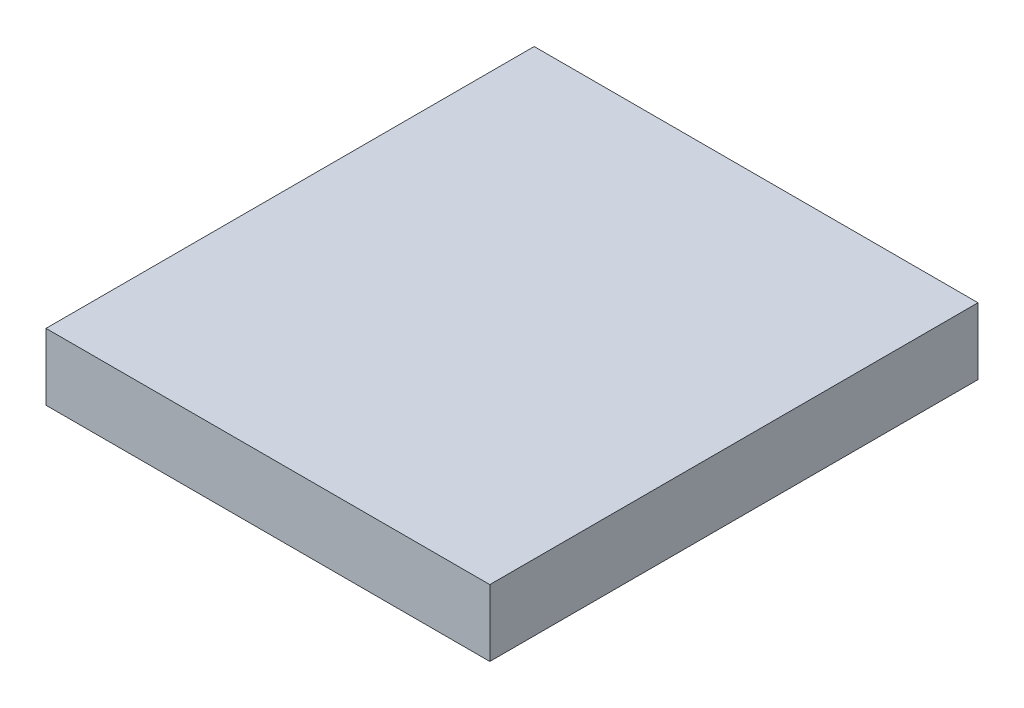
ISO-10303-21;
HEADER;
FILE_DESCRIPTION(('STEP AP214'),'2;1');
FILE_NAME('part.step','',(''),(''),'','','');
FILE_SCHEMA(('AUTOMOTIVE_DESIGN { 1 0 10303 214 1 1 1 1 }'));
ENDSEC;
DATA;
#1=APPLICATION_CONTEXT('core data for automotive mechanical design processes');
#2=APPLICATION_PROTOCOL_DEFINITION('international standard','automotive_design',2000,#1);
#3=PRODUCT_CONTEXT('',#1,'mechanical');
#4=PRODUCT('Part','Part','',(#3));
#5=PRODUCT_RELATED_PRODUCT_CATEGORY('part','',(#4));
#6=PRODUCT_DEFINITION_FORMATION('','',#4);
#7=PRODUCT_DEFINITION_CONTEXT('part definition',#1,'design');
#8=PRODUCT_DEFINITION('design','',#6,#7);
#9=PRODUCT_DEFINITION_SHAPE('','',#8);
#10=(LENGTH_UNIT() NAMED_UNIT(*) SI_UNIT(.MILLI.,.METRE.));
#11=(NAMED_UNIT(*) PLANE_ANGLE_UNIT() SI_UNIT($,.RADIAN.));
#12=(NAMED_UNIT(*) SI_UNIT($,.STERADIAN.) SOLID_ANGLE_UNIT());
#13=UNCERTAINTY_MEASURE_WITH_UNIT(LENGTH_MEASURE(1.E-05),#10,'distance_accuracy_value','');
#14=(GEOMETRIC_REPRESENTATION_CONTEXT(3) GLOBAL_UNCERTAINTY_ASSIGNED_CONTEXT((#13)) GLOBAL_UNIT_ASSIGNED_CONTEXT((#10,
#11,#12)) REPRESENTATION_CONTEXT('',''));
#15=CARTESIAN_POINT('',(0.,0.,0.));
#16=DIRECTION('',(0.,0.,1.));
#17=DIRECTION('',(1.,0.,0.));
#18=AXIS2_PLACEMENT_3D('',#15,#16,#17);
#19=CARTESIAN_POINT('',(7.9375,-2.38252,-8.73124999999999));
#20=DIRECTION('',(1.,0.,0.));
#21=DIRECTION('',(0.,0.,-1.));
#22=AXIS2_PLACEMENT_3D('',#19,#20,#21);
#23=PLANE('',#22);
#24=DIRECTION('',(0.,0.,-1.));
#25=VECTOR('',#24,1.);
#26=CARTESIAN_POINT('',(7.9375,0.,-8.73124999999999));
#27=LINE('',#26,#25);
#28=CARTESIAN_POINT('',(7.93750000000001,0.,8.73125000000001));
#29=VERTEX_POINT('',#28);
#30=CARTESIAN_POINT('',(7.9375,0.,-8.73124999999999));
#31=VERTEX_POINT('',#30);
#32=EDGE_CURVE('E100',#29,#31,#27,.T.);
#33=ORIENTED_EDGE('',*,*,#32,.F.);
#34=DIRECTION('',(0.,1.,0.));
#35=VECTOR('',#34,1.);
#36=CARTESIAN_POINT('',(7.93750000000001,-2.38252,8.73125000000001));
#37=LINE('',#36,#35);
#38=CARTESIAN_POINT('',(7.93750000000001,-2.38252,8.73125000000001));
#39=VERTEX_POINT('',#38);
#40=EDGE_CURVE('E11',#39,#29,#37,.T.);
#41=ORIENTED_EDGE('',*,*,#40,.F.);
#42=DIRECTION('',(0.,0.,-1.));
#43=VECTOR('',#42,1.);
#44=CARTESIAN_POINT('',(7.9375,-2.38252,-8.73124999999999));
#45=LINE('',#44,#43);
#46=CARTESIAN_POINT('',(7.9375,-2.38252,-8.73124999999999));
#47=VERTEX_POINT('',#46);
#48=EDGE_CURVE('E94',#39,#47,#45,.T.);
#49=ORIENTED_EDGE('',*,*,#48,.T.);
#50=DIRECTION('',(0.,1.,0.));
#51=VECTOR('',#50,1.);
#52=CARTESIAN_POINT('',(7.9375,-2.38252,-8.73124999999999));
#53=LINE('',#52,#51);
#54=EDGE_CURVE('E39',#47,#31,#53,.T.);
#55=ORIENTED_EDGE('',*,*,#54,.T.);
#56=EDGE_LOOP('',(#33,#41,#49,#55));
#57=FACE_BOUND('',#56,.T.);
#58=ADVANCED_FACE('F36',(#57),#23,.T.);
#59=CARTESIAN_POINT('',(-7.93749999999999,-2.38252,8.73125000000001));
#60=DIRECTION('',(0.,0.,1.));
#61=DIRECTION('',(1.,0.,0.));
#62=AXIS2_PLACEMENT_3D('',#59,#60,#61);
#63=PLANE('',#62);
#64=DIRECTION('',(1.,0.,0.));
#65=VECTOR('',#64,1.);
#66=CARTESIAN_POINT('',(-7.93749999999999,0.,8.73125000000001));
#67=LINE('',#66,#65);
#68=CARTESIAN_POINT('',(-7.93749999999999,0.,8.73125000000001));
#69=VERTEX_POINT('',#68);
#70=EDGE_CURVE('E96',#69,#29,#67,.T.);
#71=ORIENTED_EDGE('',*,*,#70,.F.);
#72=DIRECTION('',(0.,1.,0.));
#73=VECTOR('',#72,1.);
#74=CARTESIAN_POINT('',(-7.93749999999999,-2.38252,8.73125000000001));
#75=LINE('',#74,#73);
#76=CARTESIAN_POINT('',(-7.93749999999999,-2.38252,8.73125000000001));
#77=VERTEX_POINT('',#76);
#78=EDGE_CURVE('E45',#77,#69,#75,.T.);
#79=ORIENTED_EDGE('',*,*,#78,.F.);
#80=DIRECTION('',(1.,0.,0.));
#81=VECTOR('',#80,1.);
#82=CARTESIAN_POINT('',(-7.93749999999999,-2.38252,8.73125000000001));
#83=LINE('',#82,#81);
#84=EDGE_CURVE('E91',#77,#39,#83,.T.);
#85=ORIENTED_EDGE('',*,*,#84,.T.);
#86=ORIENTED_EDGE('',*,*,#40,.T.);
#87=EDGE_LOOP('',(#71,#79,#85,#86));
#88=FACE_BOUND('',#87,.T.);
#89=ADVANCED_FACE('F110',(#88),#63,.T.);
#90=CARTESIAN_POINT('',(-7.9375,-2.38252,-8.73124999999999));
#91=DIRECTION('',(-1.,0.,0.));
#92=DIRECTION('',(0.,0.,1.));
#93=AXIS2_PLACEMENT_3D('',#90,#91,#92);
#94=PLANE('',#93);
#95=DIRECTION('',(0.,0.,1.));
#96=VECTOR('',#95,1.);
#97=CARTESIAN_POINT('',(-7.9375,0.,-8.73124999999999));
#98=LINE('',#97,#96);
#99=CARTESIAN_POINT('',(-7.9375,0.,-8.73124999999999));
#100=VERTEX_POINT('',#99);
#101=EDGE_CURVE('E86',#100,#69,#98,.T.);
#102=ORIENTED_EDGE('',*,*,#101,.F.);
#103=DIRECTION('',(0.,1.,0.));
#104=VECTOR('',#103,1.);
#105=CARTESIAN_POINT('',(-7.9375,-2.38252,-8.73124999999999));
#106=LINE('',#105,#104);
#107=CARTESIAN_POINT('',(-7.9375,-2.38252,-8.73124999999999));
#108=VERTEX_POINT('',#107);
#109=EDGE_CURVE('E81',#108,#100,#106,.T.);
#110=ORIENTED_EDGE('',*,*,#109,.F.);
#111=DIRECTION('',(0.,0.,1.));
#112=VECTOR('',#111,1.);
#113=CARTESIAN_POINT('',(-7.9375,-2.38252,-8.73124999999999));
#114=LINE('',#113,#112);
#115=EDGE_CURVE('E84',#108,#77,#114,.T.);
#116=ORIENTED_EDGE('',*,*,#115,.T.);
#117=ORIENTED_EDGE('',*,*,#78,.T.);
#118=EDGE_LOOP('',(#102,#110,#116,#117));
#119=FACE_BOUND('',#118,.T.);
#120=ADVANCED_FACE('F83',(#119),#94,.T.);
#121=CARTESIAN_POINT('',(-7.9375,-2.38252,-8.73124999999999));
#122=DIRECTION('',(0.,0.,-1.));
#123=DIRECTION('',(-1.,0.,0.));
#124=AXIS2_PLACEMENT_3D('',#121,#122,#123);
#125=PLANE('',#124);
#126=DIRECTION('',(-1.,0.,0.));
#127=VECTOR('',#126,1.);
#128=CARTESIAN_POINT('',(-7.9375,0.,-8.73124999999999));
#129=LINE('',#128,#127);
#130=EDGE_CURVE('E103',#31,#100,#129,.T.);
#131=ORIENTED_EDGE('',*,*,#130,.F.);
#132=ORIENTED_EDGE('',*,*,#54,.F.);
#133=DIRECTION('',(-1.,0.,0.));
#134=VECTOR('',#133,1.);
#135=CARTESIAN_POINT('',(-7.9375,-2.38252,-8.73124999999999));
#136=LINE('',#135,#134);
#137=EDGE_CURVE('E90',#47,#108,#136,.T.);
#138=ORIENTED_EDGE('',*,*,#137,.T.);
#139=ORIENTED_EDGE('',*,*,#109,.T.);
#140=EDGE_LOOP('',(#131,#132,#138,#139));
#141=FACE_BOUND('',#140,.T.);
#142=ADVANCED_FACE('F93',(#141),#125,.T.);
#143=CARTESIAN_POINT('',(0.,-2.38252,0.));
#144=DIRECTION('',(0.,1.,0.));
#145=DIRECTION('',(0.,0.,1.));
#146=AXIS2_PLACEMENT_3D('',#143,#144,#145);
#147=PLANE('',#146);
#148=ORIENTED_EDGE('',*,*,#48,.F.);
#149=ORIENTED_EDGE('',*,*,#84,.F.);
#150=ORIENTED_EDGE('',*,*,#115,.F.);
#151=ORIENTED_EDGE('',*,*,#137,.F.);
#152=EDGE_LOOP('',(#148,#149,#150,#151));
#153=FACE_BOUND('',#152,.T.);
#154=ADVANCED_FACE('F89',(#153),#147,.F.);
#155=CARTESIAN_POINT('',(0.,0.,0.));
#156=DIRECTION('',(0.,1.,0.));
#157=DIRECTION('',(0.,0.,1.));
#158=AXIS2_PLACEMENT_3D('',#155,#156,#157);
#159=PLANE('',#158);
#160=ORIENTED_EDGE('',*,*,#32,.T.);
#161=ORIENTED_EDGE('',*,*,#130,.T.);
#162=ORIENTED_EDGE('',*,*,#101,.T.);
#163=ORIENTED_EDGE('',*,*,#70,.T.);
#164=EDGE_LOOP('',(#160,#161,#162,#163));
#165=FACE_BOUND('',#164,.T.);
#166=ADVANCED_FACE('F109',(#165),#159,.T.);
#167=CLOSED_SHELL('',(#58,#89,#120,#142,#154,#166));
#168=MANIFOLD_SOLID_BREP('B2',#167);
#169=ADVANCED_BREP_SHAPE_REPRESENTATION('',(#18,#168),#14);
#170=SHAPE_DEFINITION_REPRESENTATION(#9,#169);
ENDSEC;
END-ISO-10303-21;
